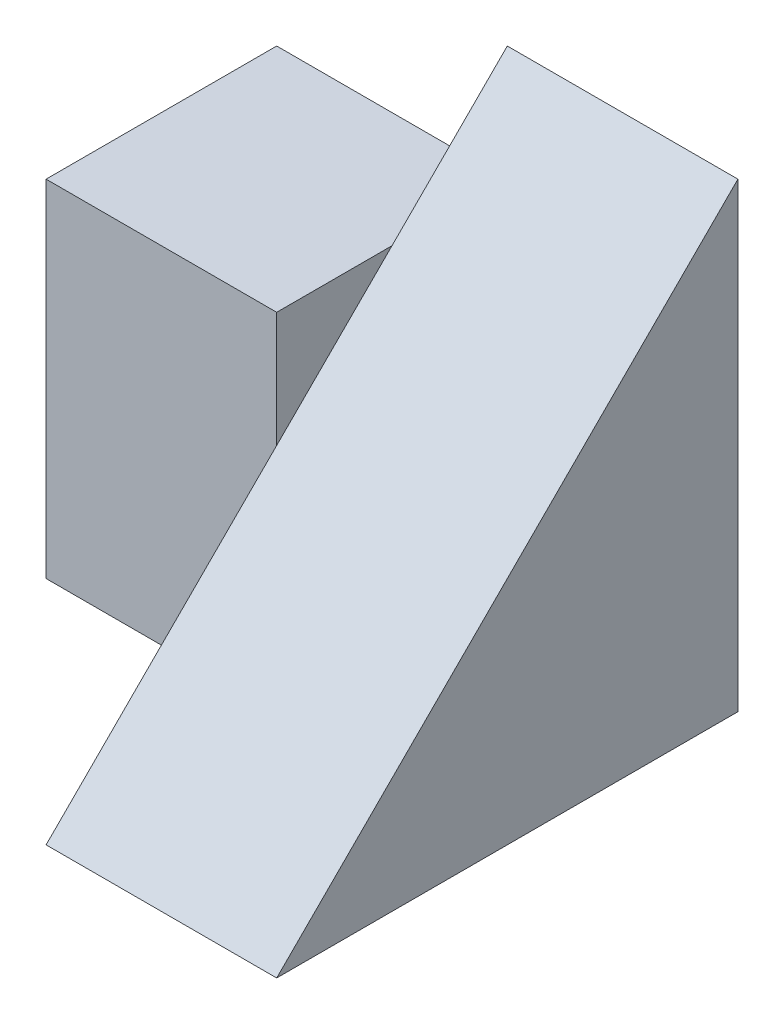
ISO-10303-21;
HEADER;
FILE_DESCRIPTION(('STEP AP214'),'2;1');
FILE_NAME('part.step','',(''),(''),'','','');
FILE_SCHEMA(('AUTOMOTIVE_DESIGN { 1 0 10303 214 1 1 1 1 }'));
ENDSEC;
DATA;
#1=APPLICATION_CONTEXT('core data for automotive mechanical design processes');
#2=APPLICATION_PROTOCOL_DEFINITION('international standard','automotive_design',2000,#1);
#3=PRODUCT_CONTEXT('',#1,'mechanical');
#4=PRODUCT('Part','Part','',(#3));
#5=PRODUCT_RELATED_PRODUCT_CATEGORY('part','',(#4));
#6=PRODUCT_DEFINITION_FORMATION('','',#4);
#7=PRODUCT_DEFINITION_CONTEXT('part definition',#1,'design');
#8=PRODUCT_DEFINITION('design','',#6,#7);
#9=PRODUCT_DEFINITION_SHAPE('','',#8);
#10=(LENGTH_UNIT() NAMED_UNIT(*) SI_UNIT(.MILLI.,.METRE.));
#11=(NAMED_UNIT(*) PLANE_ANGLE_UNIT() SI_UNIT($,.RADIAN.));
#12=(NAMED_UNIT(*) SI_UNIT($,.STERADIAN.) SOLID_ANGLE_UNIT());
#13=UNCERTAINTY_MEASURE_WITH_UNIT(LENGTH_MEASURE(1.E-05),#10,'distance_accuracy_value','');
#14=(GEOMETRIC_REPRESENTATION_CONTEXT(3) GLOBAL_UNCERTAINTY_ASSIGNED_CONTEXT((#13)) GLOBAL_UNIT_ASSIGNED_CONTEXT((#10,
#11,#12)) REPRESENTATION_CONTEXT('',''));
#15=CARTESIAN_POINT('',(0.,0.,0.));
#16=DIRECTION('',(0.,0.,1.));
#17=DIRECTION('',(1.,0.,0.));
#18=AXIS2_PLACEMENT_3D('',#15,#16,#17);
#19=CARTESIAN_POINT('',(0.,0.,0.));
#20=DIRECTION('',(-1.,0.,0.));
#21=DIRECTION('',(0.,0.,1.));
#22=AXIS2_PLACEMENT_3D('',#19,#20,#21);
#23=PLANE('',#22);
#24=DIRECTION('',(0.,0.707106781186548,-0.707106781186548));
#25=VECTOR('',#24,1.);
#26=CARTESIAN_POINT('',(0.,4.,-4.));
#27=LINE('',#26,#25);
#28=CARTESIAN_POINT('',(0.,3.,-3.));
#29=VERTEX_POINT('',#28);
#30=CARTESIAN_POINT('',(0.,4.,-4.));
#31=VERTEX_POINT('',#30);
#32=EDGE_CURVE('E103',#29,#31,#27,.T.);
#33=ORIENTED_EDGE('',*,*,#32,.T.);
#34=DIRECTION('',(0.,1.,0.));
#35=VECTOR('',#34,1.);
#36=CARTESIAN_POINT('',(0.,0.,-4.));
#37=LINE('',#36,#35);
#38=CARTESIAN_POINT('',(0.,3.,-4.));
#39=VERTEX_POINT('',#38);
#40=EDGE_CURVE('E111',#39,#31,#37,.T.);
#41=ORIENTED_EDGE('',*,*,#40,.F.);
#42=DIRECTION('',(0.,0.,-1.));
#43=VECTOR('',#42,1.);
#44=CARTESIAN_POINT('',(0.,3.,-4.));
#45=LINE('',#44,#43);
#46=EDGE_CURVE('E36',#29,#39,#45,.T.);
#47=ORIENTED_EDGE('',*,*,#46,.F.);
#48=EDGE_LOOP('',(#33,#41,#47));
#49=FACE_BOUND('',#48,.T.);
#50=ADVANCED_FACE('F32',(#49),#23,.T.);
#51=CARTESIAN_POINT('',(2.,0.,0.));
#52=DIRECTION('',(0.,1.,0.));
#53=DIRECTION('',(0.,0.,1.));
#54=AXIS2_PLACEMENT_3D('',#51,#52,#53);
#55=PLANE('',#54);
#56=DIRECTION('',(0.,0.,1.));
#57=VECTOR('',#56,1.);
#58=CARTESIAN_POINT('',(0.,0.,0.));
#59=LINE('',#58,#57);
#60=CARTESIAN_POINT('',(0.,0.,-4.));
#61=VERTEX_POINT('',#60);
#62=CARTESIAN_POINT('',(0.,0.,-2.));
#63=VERTEX_POINT('',#62);
#64=EDGE_CURVE('E152',#61,#63,#59,.T.);
#65=ORIENTED_EDGE('',*,*,#64,.F.);
#66=DIRECTION('',(-1.,0.,0.));
#67=VECTOR('',#66,1.);
#68=CARTESIAN_POINT('',(2.,0.,-4.));
#69=LINE('',#68,#67);
#70=CARTESIAN_POINT('',(2.,0.,-4.));
#71=VERTEX_POINT('',#70);
#72=EDGE_CURVE('E42',#71,#61,#69,.T.);
#73=ORIENTED_EDGE('',*,*,#72,.F.);
#74=DIRECTION('',(0.,0.,-1.));
#75=VECTOR('',#74,1.);
#76=CARTESIAN_POINT('',(2.,0.,0.));
#77=LINE('',#76,#75);
#78=CARTESIAN_POINT('',(2.,0.,0.));
#79=VERTEX_POINT('',#78);
#80=EDGE_CURVE('E58',#79,#71,#77,.T.);
#81=ORIENTED_EDGE('',*,*,#80,.F.);
#82=DIRECTION('',(-1.,0.,0.));
#83=VECTOR('',#82,1.);
#84=CARTESIAN_POINT('',(2.,0.,0.));
#85=LINE('',#84,#83);
#86=CARTESIAN_POINT('',(0.,0.,0.));
#87=VERTEX_POINT('',#86);
#88=EDGE_CURVE('E11',#79,#87,#85,.T.);
#89=ORIENTED_EDGE('',*,*,#88,.T.);
#90=DIRECTION('',(0.,0.,-1.));
#91=VECTOR('',#90,1.);
#92=CARTESIAN_POINT('',(0.,0.,0.));
#93=LINE('',#92,#91);
#94=EDGE_CURVE('E105',#87,#63,#93,.T.);
#95=ORIENTED_EDGE('',*,*,#94,.T.);
#96=EDGE_LOOP('',(#65,#73,#81,#89,#95));
#97=FACE_BOUND('',#96,.T.);
#98=ADVANCED_FACE('F34',(#97),#55,.F.);
#99=CARTESIAN_POINT('',(2.,0.,-4.));
#100=DIRECTION('',(0.,0.,1.));
#101=DIRECTION('',(1.,0.,0.));
#102=AXIS2_PLACEMENT_3D('',#99,#100,#101);
#103=PLANE('',#102);
#104=DIRECTION('',(0.,-1.,0.));
#105=VECTOR('',#104,1.);
#106=CARTESIAN_POINT('',(0.,0.,-4.));
#107=LINE('',#106,#105);
#108=EDGE_CURVE('E131',#39,#61,#107,.T.);
#109=ORIENTED_EDGE('',*,*,#108,.F.);
#110=ORIENTED_EDGE('',*,*,#40,.T.);
#111=DIRECTION('',(-1.,0.,0.));
#112=VECTOR('',#111,1.);
#113=CARTESIAN_POINT('',(2.,4.,-4.));
#114=LINE('',#113,#112);
#115=CARTESIAN_POINT('',(2.,4.,-4.));
#116=VERTEX_POINT('',#115);
#117=EDGE_CURVE('E118',#116,#31,#114,.T.);
#118=ORIENTED_EDGE('',*,*,#117,.F.);
#119=DIRECTION('',(0.,1.,0.));
#120=VECTOR('',#119,1.);
#121=CARTESIAN_POINT('',(2.,0.,-4.));
#122=LINE('',#121,#120);
#123=EDGE_CURVE('E116',#71,#116,#122,.T.);
#124=ORIENTED_EDGE('',*,*,#123,.F.);
#125=ORIENTED_EDGE('',*,*,#72,.T.);
#126=EDGE_LOOP('',(#109,#110,#118,#124,#125));
#127=FACE_BOUND('',#126,.T.);
#128=ADVANCED_FACE('F162',(#127),#103,.F.);
#129=CARTESIAN_POINT('',(2.,0.,0.));
#130=DIRECTION('',(-1.,0.,0.));
#131=DIRECTION('',(0.,0.,1.));
#132=AXIS2_PLACEMENT_3D('',#129,#130,#131);
#133=PLANE('',#132);
#134=ORIENTED_EDGE('',*,*,#123,.T.);
#135=DIRECTION('',(0.,0.707106781186548,-0.707106781186548));
#136=VECTOR('',#135,1.);
#137=CARTESIAN_POINT('',(2.,4.,-4.));
#138=LINE('',#137,#136);
#139=EDGE_CURVE('E154',#79,#116,#138,.T.);
#140=ORIENTED_EDGE('',*,*,#139,.F.);
#141=ORIENTED_EDGE('',*,*,#80,.T.);
#142=EDGE_LOOP('',(#134,#140,#141));
#143=FACE_BOUND('',#142,.T.);
#144=ADVANCED_FACE('F207',(#143),#133,.F.);
#145=CARTESIAN_POINT('',(0.,2.,-2.));
#146=VERTEX_POINT('',#145);
#147=EDGE_CURVE('E95',#87,#146,#27,.T.);
#148=ORIENTED_EDGE('',*,*,#147,.T.);
#149=DIRECTION('',(0.,1.,0.));
#150=VECTOR('',#149,1.);
#151=CARTESIAN_POINT('',(0.,0.,-2.));
#152=LINE('',#151,#150);
#153=EDGE_CURVE('E107',#63,#146,#152,.T.);
#154=ORIENTED_EDGE('',*,*,#153,.F.);
#155=ORIENTED_EDGE('',*,*,#94,.F.);
#156=EDGE_LOOP('',(#148,#154,#155));
#157=FACE_BOUND('',#156,.T.);
#158=ADVANCED_FACE('F106',(#157),#23,.T.);
#159=CARTESIAN_POINT('',(-2.,0.,-2.));
#160=DIRECTION('',(0.,0.,-1.));
#161=DIRECTION('',(-1.,0.,0.));
#162=AXIS2_PLACEMENT_3D('',#159,#160,#161);
#163=PLANE('',#162);
#164=ORIENTED_EDGE('',*,*,#153,.T.);
#165=DIRECTION('',(0.,-1.,0.));
#166=VECTOR('',#165,1.);
#167=CARTESIAN_POINT('',(0.,0.,-2.));
#168=LINE('',#167,#166);
#169=CARTESIAN_POINT('',(0.,3.,-2.));
#170=VERTEX_POINT('',#169);
#171=EDGE_CURVE('E101',#170,#146,#168,.T.);
#172=ORIENTED_EDGE('',*,*,#171,.F.);
#173=DIRECTION('',(1.,0.,0.));
#174=VECTOR('',#173,1.);
#175=CARTESIAN_POINT('',(-2.,3.,-2.));
#176=LINE('',#175,#174);
#177=CARTESIAN_POINT('',(-2.,3.,-2.));
#178=VERTEX_POINT('',#177);
#179=EDGE_CURVE('E123',#178,#170,#176,.T.);
#180=ORIENTED_EDGE('',*,*,#179,.F.);
#181=DIRECTION('',(0.,1.,0.));
#182=VECTOR('',#181,1.);
#183=CARTESIAN_POINT('',(-2.,0.,-2.));
#184=LINE('',#183,#182);
#185=CARTESIAN_POINT('',(-2.,0.,-2.));
#186=VERTEX_POINT('',#185);
#187=EDGE_CURVE('E140',#186,#178,#184,.T.);
#188=ORIENTED_EDGE('',*,*,#187,.F.);
#189=DIRECTION('',(1.,0.,0.));
#190=VECTOR('',#189,1.);
#191=CARTESIAN_POINT('',(-2.,0.,-2.));
#192=LINE('',#191,#190);
#193=EDGE_CURVE('E112',#186,#63,#192,.T.);
#194=ORIENTED_EDGE('',*,*,#193,.T.);
#195=EDGE_LOOP('',(#164,#172,#180,#188,#194));
#196=FACE_BOUND('',#195,.T.);
#197=ADVANCED_FACE('F189',(#196),#163,.F.);
#198=CARTESIAN_POINT('',(-2.,3.,-4.));
#199=DIRECTION('',(0.,-1.,0.));
#200=DIRECTION('',(0.,0.,-1.));
#201=AXIS2_PLACEMENT_3D('',#198,#199,#200);
#202=PLANE('',#201);
#203=EDGE_CURVE('E137',#170,#29,#45,.T.);
#204=ORIENTED_EDGE('',*,*,#203,.T.);
#205=ORIENTED_EDGE('',*,*,#46,.T.);
#206=DIRECTION('',(1.,0.,0.));
#207=VECTOR('',#206,1.);
#208=CARTESIAN_POINT('',(-2.,3.,-4.));
#209=LINE('',#208,#207);
#210=CARTESIAN_POINT('',(-2.,3.,-4.));
#211=VERTEX_POINT('',#210);
#212=EDGE_CURVE('E141',#211,#39,#209,.T.);
#213=ORIENTED_EDGE('',*,*,#212,.F.);
#214=DIRECTION('',(0.,0.,-1.));
#215=VECTOR('',#214,1.);
#216=CARTESIAN_POINT('',(-2.,3.,-4.));
#217=LINE('',#216,#215);
#218=EDGE_CURVE('E145',#178,#211,#217,.T.);
#219=ORIENTED_EDGE('',*,*,#218,.F.);
#220=ORIENTED_EDGE('',*,*,#179,.T.);
#221=EDGE_LOOP('',(#204,#205,#213,#219,#220));
#222=FACE_BOUND('',#221,.T.);
#223=ADVANCED_FACE('F185',(#222),#202,.F.);
#224=CARTESIAN_POINT('',(-2.,0.,0.));
#225=DIRECTION('',(1.,0.,0.));
#226=DIRECTION('',(0.,0.,-1.));
#227=AXIS2_PLACEMENT_3D('',#224,#225,#226);
#228=PLANE('',#227);
#229=ORIENTED_EDGE('',*,*,#218,.T.);
#230=DIRECTION('',(0.,0.832050294337844,-0.554700196225229));
#231=VECTOR('',#230,1.);
#232=CARTESIAN_POINT('',(-2.,-0.923076923076923,-1.38461538461538));
#233=LINE('',#232,#231);
#234=EDGE_CURVE('E150',#186,#211,#233,.T.);
#235=ORIENTED_EDGE('',*,*,#234,.F.);
#236=ORIENTED_EDGE('',*,*,#187,.T.);
#237=EDGE_LOOP('',(#229,#235,#236));
#238=FACE_BOUND('',#237,.T.);
#239=ADVANCED_FACE('F219',(#238),#228,.F.);
#240=CARTESIAN_POINT('',(0.,-0.923076923076923,-1.38461538461538));
#241=DIRECTION('',(0.,0.554700196225229,0.832050294337844));
#242=DIRECTION('',(0.,-0.832050294337844,0.554700196225229));
#243=AXIS2_PLACEMENT_3D('',#240,#241,#242);
#244=PLANE('',#243);
#245=ORIENTED_EDGE('',*,*,#234,.T.);
#246=ORIENTED_EDGE('',*,*,#212,.T.);
#247=DIRECTION('',(0.,0.832050294337844,-0.554700196225229));
#248=VECTOR('',#247,1.);
#249=CARTESIAN_POINT('',(0.,-0.923076923076923,-1.38461538461538));
#250=LINE('',#249,#248);
#251=EDGE_CURVE('E166',#63,#39,#250,.T.);
#252=ORIENTED_EDGE('',*,*,#251,.F.);
#253=ORIENTED_EDGE('',*,*,#193,.F.);
#254=EDGE_LOOP('',(#245,#246,#252,#253));
#255=FACE_BOUND('',#254,.T.);
#256=ADVANCED_FACE('F178',(#255),#244,.F.);
#257=CARTESIAN_POINT('',(0.,0.,0.));
#258=DIRECTION('',(-1.,0.,0.));
#259=DIRECTION('',(0.,0.,1.));
#260=AXIS2_PLACEMENT_3D('',#257,#258,#259);
#261=PLANE('',#260);
#262=ORIENTED_EDGE('',*,*,#64,.T.);
#263=ORIENTED_EDGE('',*,*,#251,.T.);
#264=ORIENTED_EDGE('',*,*,#108,.T.);
#265=EDGE_LOOP('',(#262,#263,#264));
#266=FACE_BOUND('',#265,.T.);
#267=ADVANCED_FACE('F175',(#266),#261,.T.);
#268=CARTESIAN_POINT('',(0.,0.,0.));
#269=DIRECTION('',(1.,0.,0.));
#270=DIRECTION('',(0.,0.,-1.));
#271=AXIS2_PLACEMENT_3D('',#268,#269,#270);
#272=PLANE('',#271);
#273=ORIENTED_EDGE('',*,*,#171,.T.);
#274=EDGE_CURVE('E50',#146,#29,#27,.T.);
#275=ORIENTED_EDGE('',*,*,#274,.T.);
#276=ORIENTED_EDGE('',*,*,#203,.F.);
#277=EDGE_LOOP('',(#273,#275,#276));
#278=FACE_BOUND('',#277,.T.);
#279=ADVANCED_FACE('F190',(#278),#272,.T.);
#280=CARTESIAN_POINT('',(0.,4.,-4.));
#281=DIRECTION('',(0.,-0.707106781186547,-0.707106781186547));
#282=DIRECTION('',(0.,0.707106781186548,-0.707106781186548));
#283=AXIS2_PLACEMENT_3D('',#280,#281,#282);
#284=PLANE('',#283);
#285=ORIENTED_EDGE('',*,*,#139,.T.);
#286=ORIENTED_EDGE('',*,*,#117,.T.);
#287=ORIENTED_EDGE('',*,*,#32,.F.);
#288=ORIENTED_EDGE('',*,*,#274,.F.);
#289=ORIENTED_EDGE('',*,*,#147,.F.);
#290=ORIENTED_EDGE('',*,*,#88,.F.);
#291=EDGE_LOOP('',(#285,#286,#287,#288,#289,#290));
#292=FACE_BOUND('',#291,.T.);
#293=ADVANCED_FACE('F97',(#292),#284,.F.);
#294=CLOSED_SHELL('',(#50,#98,#128,#144,#158,#197,#223,#239,#256,#267,#279,#293));
#295=MANIFOLD_SOLID_BREP('B2',#294);
#296=ADVANCED_BREP_SHAPE_REPRESENTATION('',(#18,#295),#14);
#297=SHAPE_DEFINITION_REPRESENTATION(#9,#296);
ENDSEC;
END-ISO-10303-21;
